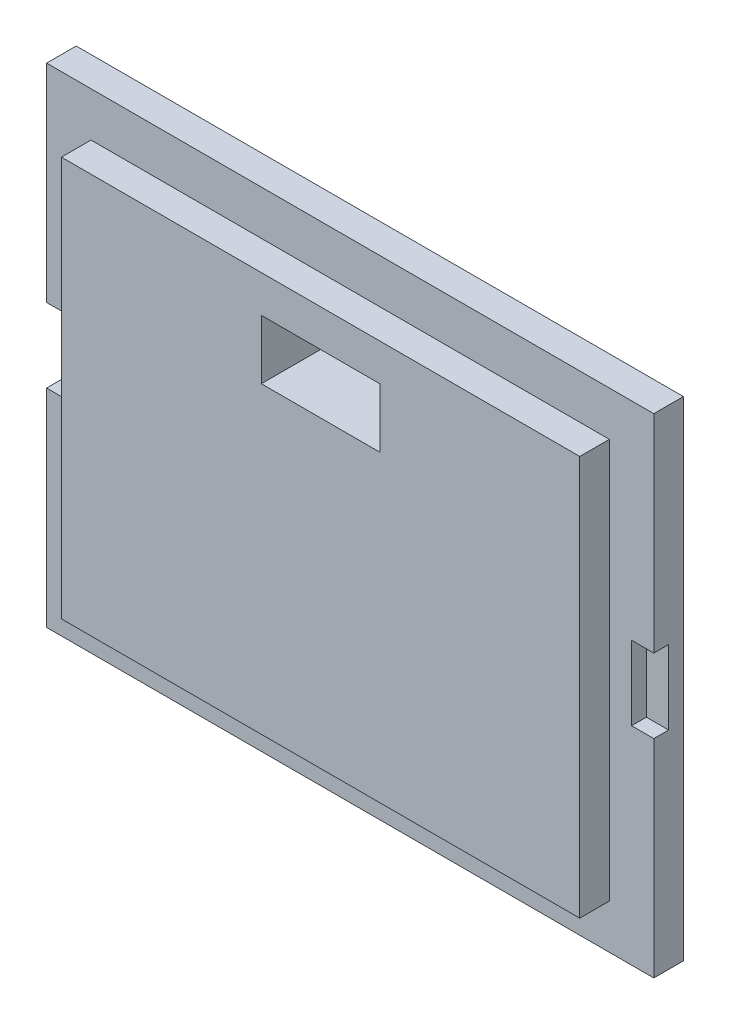
ISO-10303-21;
HEADER;
FILE_DESCRIPTION(('STEP AP214'),'2;1');
FILE_NAME('part.step','',(''),(''),'','','');
FILE_SCHEMA(('AUTOMOTIVE_DESIGN { 1 0 10303 214 1 1 1 1 }'));
ENDSEC;
DATA;
#1=APPLICATION_CONTEXT('core data for automotive mechanical design processes');
#2=APPLICATION_PROTOCOL_DEFINITION('international standard','automotive_design',2000,#1);
#3=PRODUCT_CONTEXT('',#1,'mechanical');
#4=PRODUCT('Part','Part','',(#3));
#5=PRODUCT_RELATED_PRODUCT_CATEGORY('part','',(#4));
#6=PRODUCT_DEFINITION_FORMATION('','',#4);
#7=PRODUCT_DEFINITION_CONTEXT('part definition',#1,'design');
#8=PRODUCT_DEFINITION('design','',#6,#7);
#9=PRODUCT_DEFINITION_SHAPE('','',#8);
#10=(LENGTH_UNIT() NAMED_UNIT(*) SI_UNIT(.MILLI.,.METRE.));
#11=(NAMED_UNIT(*) PLANE_ANGLE_UNIT() SI_UNIT($,.RADIAN.));
#12=(NAMED_UNIT(*) SI_UNIT($,.STERADIAN.) SOLID_ANGLE_UNIT());
#13=UNCERTAINTY_MEASURE_WITH_UNIT(LENGTH_MEASURE(1.E-05),#10,'distance_accuracy_value','');
#14=(GEOMETRIC_REPRESENTATION_CONTEXT(3) GLOBAL_UNCERTAINTY_ASSIGNED_CONTEXT((#13)) GLOBAL_UNIT_ASSIGNED_CONTEXT((#10,
#11,#12)) REPRESENTATION_CONTEXT('',''));
#15=CARTESIAN_POINT('',(0.,0.,0.));
#16=DIRECTION('',(0.,0.,1.));
#17=DIRECTION('',(1.,0.,0.));
#18=AXIS2_PLACEMENT_3D('',#15,#16,#17);
#19=CARTESIAN_POINT('',(0.,0.,2.));
#20=DIRECTION('',(0.,0.,1.));
#21=DIRECTION('',(1.,0.,0.));
#22=AXIS2_PLACEMENT_3D('',#19,#20,#21);
#23=PLANE('',#22);
#24=DIRECTION('',(1.,0.,0.));
#25=VECTOR('',#24,1.);
#26=CARTESIAN_POINT('',(20.5,-2.5,2.));
#27=LINE('',#26,#25);
#28=CARTESIAN_POINT('',(19.,-2.5,2.));
#29=VERTEX_POINT('',#28);
#30=CARTESIAN_POINT('',(20.5,-2.5,2.));
#31=VERTEX_POINT('',#30);
#32=EDGE_CURVE('E190',#29,#31,#27,.T.);
#33=ORIENTED_EDGE('',*,*,#32,.F.);
#34=DIRECTION('',(0.,-1.,0.));
#35=VECTOR('',#34,1.);
#36=CARTESIAN_POINT('',(19.,2.5,2.));
#37=LINE('',#36,#35);
#38=CARTESIAN_POINT('',(19.,2.5,2.));
#39=VERTEX_POINT('',#38);
#40=EDGE_CURVE('E340',#39,#29,#37,.T.);
#41=ORIENTED_EDGE('',*,*,#40,.F.);
#42=DIRECTION('',(-1.,0.,0.));
#43=VECTOR('',#42,1.);
#44=CARTESIAN_POINT('',(20.5,2.5,2.));
#45=LINE('',#44,#43);
#46=CARTESIAN_POINT('',(20.5,2.5,2.));
#47=VERTEX_POINT('',#46);
#48=EDGE_CURVE('E338',#47,#39,#45,.T.);
#49=ORIENTED_EDGE('',*,*,#48,.F.);
#50=DIRECTION('',(0.,1.,0.));
#51=VECTOR('',#50,1.);
#52=CARTESIAN_POINT('',(20.5,16.5,2.));
#53=LINE('',#52,#51);
#54=CARTESIAN_POINT('',(20.5,16.5,2.));
#55=VERTEX_POINT('',#54);
#56=EDGE_CURVE('E195',#47,#55,#53,.T.);
#57=ORIENTED_EDGE('',*,*,#56,.T.);
#58=DIRECTION('',(-1.,0.,0.));
#59=VECTOR('',#58,1.);
#60=CARTESIAN_POINT('',(-20.5,16.5,2.));
#61=LINE('',#60,#59);
#62=CARTESIAN_POINT('',(-20.5,16.5,2.));
#63=VERTEX_POINT('',#62);
#64=EDGE_CURVE('E299',#55,#63,#61,.T.);
#65=ORIENTED_EDGE('',*,*,#64,.T.);
#66=DIRECTION('',(0.,-1.,0.));
#67=VECTOR('',#66,1.);
#68=CARTESIAN_POINT('',(-20.5,16.5,2.));
#69=LINE('',#68,#67);
#70=CARTESIAN_POINT('',(-20.5,2.5,2.));
#71=VERTEX_POINT('',#70);
#72=EDGE_CURVE('E290',#63,#71,#69,.T.);
#73=ORIENTED_EDGE('',*,*,#72,.T.);
#74=DIRECTION('',(-1.,0.,0.));
#75=VECTOR('',#74,1.);
#76=CARTESIAN_POINT('',(-20.5,2.5,2.));
#77=LINE('',#76,#75);
#78=CARTESIAN_POINT('',(-19.,2.5,2.));
#79=VERTEX_POINT('',#78);
#80=EDGE_CURVE('E205',#79,#71,#77,.T.);
#81=ORIENTED_EDGE('',*,*,#80,.F.);
#82=DIRECTION('',(0.,1.,0.));
#83=VECTOR('',#82,1.);
#84=CARTESIAN_POINT('',(-19.,2.5,2.));
#85=LINE('',#84,#83);
#86=CARTESIAN_POINT('',(-19.,-2.5,2.));
#87=VERTEX_POINT('',#86);
#88=EDGE_CURVE('E215',#87,#79,#85,.T.);
#89=ORIENTED_EDGE('',*,*,#88,.F.);
#90=DIRECTION('',(1.,0.,0.));
#91=VECTOR('',#90,1.);
#92=CARTESIAN_POINT('',(-20.5,-2.5,2.));
#93=LINE('',#92,#91);
#94=CARTESIAN_POINT('',(-20.5,-2.5,2.));
#95=VERTEX_POINT('',#94);
#96=EDGE_CURVE('E212',#95,#87,#93,.T.);
#97=ORIENTED_EDGE('',*,*,#96,.F.);
#98=CARTESIAN_POINT('',(-20.5,-16.5,2.));
#99=VERTEX_POINT('',#98);
#100=EDGE_CURVE('E294',#95,#99,#69,.T.);
#101=ORIENTED_EDGE('',*,*,#100,.T.);
#102=DIRECTION('',(1.,0.,0.));
#103=VECTOR('',#102,1.);
#104=CARTESIAN_POINT('',(-20.5,-16.5,2.));
#105=LINE('',#104,#103);
#106=CARTESIAN_POINT('',(20.5,-16.5,2.));
#107=VERTEX_POINT('',#106);
#108=EDGE_CURVE('E293',#99,#107,#105,.T.);
#109=ORIENTED_EDGE('',*,*,#108,.T.);
#110=EDGE_CURVE('E296',#107,#31,#53,.T.);
#111=ORIENTED_EDGE('',*,*,#110,.T.);
#112=EDGE_LOOP('',(#33,#41,#49,#57,#65,#73,#81,#89,#97,#101,#109,#111));
#113=FACE_BOUND('',#112,.T.);
#114=DIRECTION('',(1.,0.,0.));
#115=VECTOR('',#114,1.);
#116=CARTESIAN_POINT('',(-17.5,-13.5,2.));
#117=LINE('',#116,#115);
#118=CARTESIAN_POINT('',(-17.5,-13.5,2.));
#119=VERTEX_POINT('',#118);
#120=CARTESIAN_POINT('',(17.5,-13.5,2.));
#121=VERTEX_POINT('',#120);
#122=EDGE_CURVE('E274',#119,#121,#117,.T.);
#123=ORIENTED_EDGE('',*,*,#122,.F.);
#124=DIRECTION('',(0.,-1.,0.));
#125=VECTOR('',#124,1.);
#126=CARTESIAN_POINT('',(-17.5,13.5,2.));
#127=LINE('',#126,#125);
#128=CARTESIAN_POINT('',(-17.5,13.5,2.));
#129=VERTEX_POINT('',#128);
#130=EDGE_CURVE('E260',#129,#119,#127,.T.);
#131=ORIENTED_EDGE('',*,*,#130,.F.);
#132=DIRECTION('',(-1.,0.,0.));
#133=VECTOR('',#132,1.);
#134=CARTESIAN_POINT('',(-17.5,13.5,2.));
#135=LINE('',#134,#133);
#136=CARTESIAN_POINT('',(17.5,13.5,2.));
#137=VERTEX_POINT('',#136);
#138=EDGE_CURVE('E265',#137,#129,#135,.T.);
#139=ORIENTED_EDGE('',*,*,#138,.F.);
#140=DIRECTION('',(0.,1.,0.));
#141=VECTOR('',#140,1.);
#142=CARTESIAN_POINT('',(17.5,13.5,2.));
#143=LINE('',#142,#141);
#144=EDGE_CURVE('E276',#121,#137,#143,.T.);
#145=ORIENTED_EDGE('',*,*,#144,.F.);
#146=EDGE_LOOP('',(#123,#131,#139,#145));
#147=FACE_BOUND('',#146,.T.);
#148=ADVANCED_FACE('F35',(#113,#147),#23,.T.);
#149=CARTESIAN_POINT('',(-20.5,16.5,2.));
#150=DIRECTION('',(1.,0.,0.));
#151=DIRECTION('',(0.,0.,-1.));
#152=AXIS2_PLACEMENT_3D('',#149,#150,#151);
#153=PLANE('',#152);
#154=DIRECTION('',(0.,-1.,0.));
#155=VECTOR('',#154,1.);
#156=CARTESIAN_POINT('',(-20.5,2.5,1.));
#157=LINE('',#156,#155);
#158=CARTESIAN_POINT('',(-20.5,2.5,1.));
#159=VERTEX_POINT('',#158);
#160=CARTESIAN_POINT('',(-20.5,-2.5,1.));
#161=VERTEX_POINT('',#160);
#162=EDGE_CURVE('E202',#159,#161,#157,.T.);
#163=ORIENTED_EDGE('',*,*,#162,.F.);
#164=DIRECTION('',(0.,0.,1.));
#165=VECTOR('',#164,1.);
#166=CARTESIAN_POINT('',(-20.5,2.5,1.));
#167=LINE('',#166,#165);
#168=EDGE_CURVE('E220',#159,#71,#167,.T.);
#169=ORIENTED_EDGE('',*,*,#168,.T.);
#170=ORIENTED_EDGE('',*,*,#72,.F.);
#171=DIRECTION('',(0.,0.,-1.));
#172=VECTOR('',#171,1.);
#173=CARTESIAN_POINT('',(-20.5,16.5,2.));
#174=LINE('',#173,#172);
#175=CARTESIAN_POINT('',(-20.5,16.5,0.));
#176=VERTEX_POINT('',#175);
#177=EDGE_CURVE('E301',#63,#176,#174,.T.);
#178=ORIENTED_EDGE('',*,*,#177,.T.);
#179=DIRECTION('',(0.,-1.,0.));
#180=VECTOR('',#179,1.);
#181=CARTESIAN_POINT('',(-20.5,16.5,0.));
#182=LINE('',#181,#180);
#183=CARTESIAN_POINT('',(-20.5,-16.5,0.));
#184=VERTEX_POINT('',#183);
#185=EDGE_CURVE('E289',#176,#184,#182,.T.);
#186=ORIENTED_EDGE('',*,*,#185,.T.);
#187=DIRECTION('',(0.,0.,-1.));
#188=VECTOR('',#187,1.);
#189=CARTESIAN_POINT('',(-20.5,-16.5,2.));
#190=LINE('',#189,#188);
#191=EDGE_CURVE('E11',#99,#184,#190,.T.);
#192=ORIENTED_EDGE('',*,*,#191,.F.);
#193=ORIENTED_EDGE('',*,*,#100,.F.);
#194=DIRECTION('',(0.,0.,1.));
#195=VECTOR('',#194,1.);
#196=CARTESIAN_POINT('',(-20.5,-2.5,1.));
#197=LINE('',#196,#195);
#198=EDGE_CURVE('E211',#161,#95,#197,.T.);
#199=ORIENTED_EDGE('',*,*,#198,.F.);
#200=EDGE_LOOP('',(#163,#169,#170,#178,#186,#192,#193,#199));
#201=FACE_BOUND('',#200,.T.);
#202=ADVANCED_FACE('F37',(#201),#153,.F.);
#203=CARTESIAN_POINT('',(-20.5,-16.5,2.));
#204=DIRECTION('',(0.,1.,0.));
#205=DIRECTION('',(0.,0.,1.));
#206=AXIS2_PLACEMENT_3D('',#203,#204,#205);
#207=PLANE('',#206);
#208=DIRECTION('',(1.,0.,0.));
#209=VECTOR('',#208,1.);
#210=CARTESIAN_POINT('',(-20.5,-16.5,0.));
#211=LINE('',#210,#209);
#212=CARTESIAN_POINT('',(20.5,-16.5,0.));
#213=VERTEX_POINT('',#212);
#214=EDGE_CURVE('E304',#184,#213,#211,.T.);
#215=ORIENTED_EDGE('',*,*,#214,.T.);
#216=DIRECTION('',(0.,0.,-1.));
#217=VECTOR('',#216,1.);
#218=CARTESIAN_POINT('',(20.5,-16.5,2.));
#219=LINE('',#218,#217);
#220=EDGE_CURVE('E43',#107,#213,#219,.T.);
#221=ORIENTED_EDGE('',*,*,#220,.F.);
#222=ORIENTED_EDGE('',*,*,#108,.F.);
#223=ORIENTED_EDGE('',*,*,#191,.T.);
#224=EDGE_LOOP('',(#215,#221,#222,#223));
#225=FACE_BOUND('',#224,.T.);
#226=ADVANCED_FACE('F352',(#225),#207,.F.);
#227=CARTESIAN_POINT('',(20.5,16.5,2.));
#228=DIRECTION('',(-1.,0.,0.));
#229=DIRECTION('',(0.,0.,1.));
#230=AXIS2_PLACEMENT_3D('',#227,#228,#229);
#231=PLANE('',#230);
#232=DIRECTION('',(0.,1.,0.));
#233=VECTOR('',#232,1.);
#234=CARTESIAN_POINT('',(20.5,2.5,1.));
#235=LINE('',#234,#233);
#236=CARTESIAN_POINT('',(20.5,-2.5,1.));
#237=VERTEX_POINT('',#236);
#238=CARTESIAN_POINT('',(20.5,2.5,1.));
#239=VERTEX_POINT('',#238);
#240=EDGE_CURVE('E184',#237,#239,#235,.T.);
#241=ORIENTED_EDGE('',*,*,#240,.F.);
#242=DIRECTION('',(0.,0.,1.));
#243=VECTOR('',#242,1.);
#244=CARTESIAN_POINT('',(20.5,-2.5,1.));
#245=LINE('',#244,#243);
#246=EDGE_CURVE('E216',#237,#31,#245,.T.);
#247=ORIENTED_EDGE('',*,*,#246,.T.);
#248=ORIENTED_EDGE('',*,*,#110,.F.);
#249=ORIENTED_EDGE('',*,*,#220,.T.);
#250=DIRECTION('',(0.,1.,0.));
#251=VECTOR('',#250,1.);
#252=CARTESIAN_POINT('',(20.5,16.5,0.));
#253=LINE('',#252,#251);
#254=CARTESIAN_POINT('',(20.5,16.5,0.));
#255=VERTEX_POINT('',#254);
#256=EDGE_CURVE('E306',#213,#255,#253,.T.);
#257=ORIENTED_EDGE('',*,*,#256,.T.);
#258=DIRECTION('',(0.,0.,-1.));
#259=VECTOR('',#258,1.);
#260=CARTESIAN_POINT('',(20.5,16.5,2.));
#261=LINE('',#260,#259);
#262=EDGE_CURVE('E312',#55,#255,#261,.T.);
#263=ORIENTED_EDGE('',*,*,#262,.F.);
#264=ORIENTED_EDGE('',*,*,#56,.F.);
#265=DIRECTION('',(0.,0.,1.));
#266=VECTOR('',#265,1.);
#267=CARTESIAN_POINT('',(20.5,2.5,1.));
#268=LINE('',#267,#266);
#269=EDGE_CURVE('E179',#239,#47,#268,.T.);
#270=ORIENTED_EDGE('',*,*,#269,.F.);
#271=EDGE_LOOP('',(#241,#247,#248,#249,#257,#263,#264,#270));
#272=FACE_BOUND('',#271,.T.);
#273=ADVANCED_FACE('F193',(#272),#231,.F.);
#274=CARTESIAN_POINT('',(-20.5,16.5,2.));
#275=DIRECTION('',(0.,-1.,0.));
#276=DIRECTION('',(0.,0.,-1.));
#277=AXIS2_PLACEMENT_3D('',#274,#275,#276);
#278=PLANE('',#277);
#279=DIRECTION('',(-1.,0.,0.));
#280=VECTOR('',#279,1.);
#281=CARTESIAN_POINT('',(-20.5,16.5,0.));
#282=LINE('',#281,#280);
#283=EDGE_CURVE('E308',#255,#176,#282,.T.);
#284=ORIENTED_EDGE('',*,*,#283,.T.);
#285=ORIENTED_EDGE('',*,*,#177,.F.);
#286=ORIENTED_EDGE('',*,*,#64,.F.);
#287=ORIENTED_EDGE('',*,*,#262,.T.);
#288=EDGE_LOOP('',(#284,#285,#286,#287));
#289=FACE_BOUND('',#288,.T.);
#290=ADVANCED_FACE('F326',(#289),#278,.F.);
#291=CARTESIAN_POINT('',(0.,0.,0.));
#292=DIRECTION('',(0.,0.,1.));
#293=DIRECTION('',(1.,0.,0.));
#294=AXIS2_PLACEMENT_3D('',#291,#292,#293);
#295=PLANE('',#294);
#296=DIRECTION('',(1.,0.,0.));
#297=VECTOR('',#296,1.);
#298=CARTESIAN_POINT('',(0.,7.,0.));
#299=LINE('',#298,#297);
#300=CARTESIAN_POINT('',(-4.00000000000001,7.,0.));
#301=VERTEX_POINT('',#300);
#302=CARTESIAN_POINT('',(3.99999999999999,7.,0.));
#303=VERTEX_POINT('',#302);
#304=EDGE_CURVE('E254',#301,#303,#299,.T.);
#305=ORIENTED_EDGE('',*,*,#304,.T.);
#306=DIRECTION('',(0.,1.,0.));
#307=VECTOR('',#306,1.);
#308=CARTESIAN_POINT('',(3.99999999999999,0.,0.));
#309=LINE('',#308,#307);
#310=CARTESIAN_POINT('',(3.99999999999999,11.,0.));
#311=VERTEX_POINT('',#310);
#312=EDGE_CURVE('E257',#303,#311,#309,.T.);
#313=ORIENTED_EDGE('',*,*,#312,.T.);
#314=DIRECTION('',(-1.,0.,0.));
#315=VECTOR('',#314,1.);
#316=CARTESIAN_POINT('',(0.,11.,0.));
#317=LINE('',#316,#315);
#318=CARTESIAN_POINT('',(-4.00000000000001,11.,0.));
#319=VERTEX_POINT('',#318);
#320=EDGE_CURVE('E242',#311,#319,#317,.T.);
#321=ORIENTED_EDGE('',*,*,#320,.T.);
#322=DIRECTION('',(0.,-1.,0.));
#323=VECTOR('',#322,1.);
#324=CARTESIAN_POINT('',(-4.00000000000001,0.,0.));
#325=LINE('',#324,#323);
#326=EDGE_CURVE('E251',#319,#301,#325,.T.);
#327=ORIENTED_EDGE('',*,*,#326,.T.);
#328=EDGE_LOOP('',(#305,#313,#321,#327));
#329=FACE_BOUND('',#328,.T.);
#330=ORIENTED_EDGE('',*,*,#185,.F.);
#331=ORIENTED_EDGE('',*,*,#283,.F.);
#332=ORIENTED_EDGE('',*,*,#256,.F.);
#333=ORIENTED_EDGE('',*,*,#214,.F.);
#334=EDGE_LOOP('',(#330,#331,#332,#333));
#335=FACE_BOUND('',#334,.T.);
#336=ADVANCED_FACE('F323',(#329,#335),#295,.F.);
#337=CARTESIAN_POINT('',(-17.5,13.5,4.));
#338=DIRECTION('',(1.,0.,0.));
#339=DIRECTION('',(0.,0.,-1.));
#340=AXIS2_PLACEMENT_3D('',#337,#338,#339);
#341=PLANE('',#340);
#342=ORIENTED_EDGE('',*,*,#130,.T.);
#343=DIRECTION('',(0.,0.,-1.));
#344=VECTOR('',#343,1.);
#345=CARTESIAN_POINT('',(-17.5,-13.5,4.));
#346=LINE('',#345,#344);
#347=CARTESIAN_POINT('',(-17.5,-13.5,4.));
#348=VERTEX_POINT('',#347);
#349=EDGE_CURVE('E287',#348,#119,#346,.T.);
#350=ORIENTED_EDGE('',*,*,#349,.F.);
#351=DIRECTION('',(0.,-1.,0.));
#352=VECTOR('',#351,1.);
#353=CARTESIAN_POINT('',(-17.5,13.5,4.));
#354=LINE('',#353,#352);
#355=CARTESIAN_POINT('',(-17.5,13.5,4.));
#356=VERTEX_POINT('',#355);
#357=EDGE_CURVE('E261',#356,#348,#354,.T.);
#358=ORIENTED_EDGE('',*,*,#357,.F.);
#359=DIRECTION('',(0.,0.,-1.));
#360=VECTOR('',#359,1.);
#361=CARTESIAN_POINT('',(-17.5,13.5,4.));
#362=LINE('',#361,#360);
#363=EDGE_CURVE('E271',#356,#129,#362,.T.);
#364=ORIENTED_EDGE('',*,*,#363,.T.);
#365=EDGE_LOOP('',(#342,#350,#358,#364));
#366=FACE_BOUND('',#365,.T.);
#367=ADVANCED_FACE('F377',(#366),#341,.F.);
#368=CARTESIAN_POINT('',(-17.5,-13.5,4.));
#369=DIRECTION('',(0.,1.,0.));
#370=DIRECTION('',(-1.,0.,0.));
#371=AXIS2_PLACEMENT_3D('',#368,#369,#370);
#372=PLANE('',#371);
#373=ORIENTED_EDGE('',*,*,#122,.T.);
#374=DIRECTION('',(0.,0.,-1.));
#375=VECTOR('',#374,1.);
#376=CARTESIAN_POINT('',(17.5,-13.5,4.));
#377=LINE('',#376,#375);
#378=CARTESIAN_POINT('',(17.5,-13.5,4.));
#379=VERTEX_POINT('',#378);
#380=EDGE_CURVE('E284',#379,#121,#377,.T.);
#381=ORIENTED_EDGE('',*,*,#380,.F.);
#382=DIRECTION('',(1.,0.,0.));
#383=VECTOR('',#382,1.);
#384=CARTESIAN_POINT('',(-17.5,-13.5,4.));
#385=LINE('',#384,#383);
#386=EDGE_CURVE('E264',#348,#379,#385,.T.);
#387=ORIENTED_EDGE('',*,*,#386,.F.);
#388=ORIENTED_EDGE('',*,*,#349,.T.);
#389=EDGE_LOOP('',(#373,#381,#387,#388));
#390=FACE_BOUND('',#389,.T.);
#391=ADVANCED_FACE('F411',(#390),#372,.F.);
#392=CARTESIAN_POINT('',(17.5,13.5,4.));
#393=DIRECTION('',(-1.,0.,0.));
#394=DIRECTION('',(0.,0.,1.));
#395=AXIS2_PLACEMENT_3D('',#392,#393,#394);
#396=PLANE('',#395);
#397=ORIENTED_EDGE('',*,*,#144,.T.);
#398=DIRECTION('',(0.,0.,-1.));
#399=VECTOR('',#398,1.);
#400=CARTESIAN_POINT('',(17.5,13.5,4.));
#401=LINE('',#400,#399);
#402=CARTESIAN_POINT('',(17.5,13.5,4.));
#403=VERTEX_POINT('',#402);
#404=EDGE_CURVE('E282',#403,#137,#401,.T.);
#405=ORIENTED_EDGE('',*,*,#404,.F.);
#406=DIRECTION('',(0.,1.,0.));
#407=VECTOR('',#406,1.);
#408=CARTESIAN_POINT('',(17.5,13.5,4.));
#409=LINE('',#408,#407);
#410=EDGE_CURVE('E267',#379,#403,#409,.T.);
#411=ORIENTED_EDGE('',*,*,#410,.F.);
#412=ORIENTED_EDGE('',*,*,#380,.T.);
#413=EDGE_LOOP('',(#397,#405,#411,#412));
#414=FACE_BOUND('',#413,.T.);
#415=ADVANCED_FACE('F418',(#414),#396,.F.);
#416=CARTESIAN_POINT('',(-17.5,13.5,4.));
#417=DIRECTION('',(0.,-1.,0.));
#418=DIRECTION('',(1.,0.,0.));
#419=AXIS2_PLACEMENT_3D('',#416,#417,#418);
#420=PLANE('',#419);
#421=ORIENTED_EDGE('',*,*,#138,.T.);
#422=ORIENTED_EDGE('',*,*,#363,.F.);
#423=DIRECTION('',(-1.,0.,0.));
#424=VECTOR('',#423,1.);
#425=CARTESIAN_POINT('',(-17.5,13.5,4.));
#426=LINE('',#425,#424);
#427=EDGE_CURVE('E269',#403,#356,#426,.T.);
#428=ORIENTED_EDGE('',*,*,#427,.F.);
#429=ORIENTED_EDGE('',*,*,#404,.T.);
#430=EDGE_LOOP('',(#421,#422,#428,#429));
#431=FACE_BOUND('',#430,.T.);
#432=ADVANCED_FACE('F425',(#431),#420,.F.);
#433=CARTESIAN_POINT('',(0.,0.,4.));
#434=DIRECTION('',(0.,0.,1.));
#435=DIRECTION('',(1.,0.,0.));
#436=AXIS2_PLACEMENT_3D('',#433,#434,#435);
#437=PLANE('',#436);
#438=DIRECTION('',(0.,1.,0.));
#439=VECTOR('',#438,1.);
#440=CARTESIAN_POINT('',(3.99999999999999,7.,4.));
#441=LINE('',#440,#439);
#442=CARTESIAN_POINT('',(3.99999999999999,7.,4.));
#443=VERTEX_POINT('',#442);
#444=CARTESIAN_POINT('',(3.99999999999999,11.,4.));
#445=VERTEX_POINT('',#444);
#446=EDGE_CURVE('E223',#443,#445,#441,.T.);
#447=ORIENTED_EDGE('',*,*,#446,.F.);
#448=DIRECTION('',(1.,0.,0.));
#449=VECTOR('',#448,1.);
#450=CARTESIAN_POINT('',(-4.00000000000001,7.,4.));
#451=LINE('',#450,#449);
#452=CARTESIAN_POINT('',(-4.00000000000001,7.,4.));
#453=VERTEX_POINT('',#452);
#454=EDGE_CURVE('E236',#453,#443,#451,.T.);
#455=ORIENTED_EDGE('',*,*,#454,.F.);
#456=DIRECTION('',(0.,-1.,0.));
#457=VECTOR('',#456,1.);
#458=CARTESIAN_POINT('',(-4.00000000000001,7.,4.));
#459=LINE('',#458,#457);
#460=CARTESIAN_POINT('',(-4.00000000000001,11.,4.));
#461=VERTEX_POINT('',#460);
#462=EDGE_CURVE('E233',#461,#453,#459,.T.);
#463=ORIENTED_EDGE('',*,*,#462,.F.);
#464=DIRECTION('',(-1.,0.,0.));
#465=VECTOR('',#464,1.);
#466=CARTESIAN_POINT('',(-4.00000000000001,11.,4.));
#467=LINE('',#466,#465);
#468=EDGE_CURVE('E230',#445,#461,#467,.T.);
#469=ORIENTED_EDGE('',*,*,#468,.F.);
#470=EDGE_LOOP('',(#447,#455,#463,#469));
#471=FACE_BOUND('',#470,.T.);
#472=ORIENTED_EDGE('',*,*,#357,.T.);
#473=ORIENTED_EDGE('',*,*,#386,.T.);
#474=ORIENTED_EDGE('',*,*,#410,.T.);
#475=ORIENTED_EDGE('',*,*,#427,.T.);
#476=EDGE_LOOP('',(#472,#473,#474,#475));
#477=FACE_BOUND('',#476,.T.);
#478=ADVANCED_FACE('F432',(#471,#477),#437,.T.);
#479=CARTESIAN_POINT('',(3.99999999999999,7.,-1.));
#480=DIRECTION('',(1.,0.,0.));
#481=DIRECTION('',(0.,0.,-1.));
#482=AXIS2_PLACEMENT_3D('',#479,#480,#481);
#483=PLANE('',#482);
#484=DIRECTION('',(0.,0.,1.));
#485=VECTOR('',#484,1.);
#486=CARTESIAN_POINT('',(3.99999999999999,7.,-1.));
#487=LINE('',#486,#485);
#488=EDGE_CURVE('E240',#303,#443,#487,.T.);
#489=ORIENTED_EDGE('',*,*,#488,.T.);
#490=ORIENTED_EDGE('',*,*,#446,.T.);
#491=DIRECTION('',(0.,0.,1.));
#492=VECTOR('',#491,1.);
#493=CARTESIAN_POINT('',(3.99999999999999,11.,-1.));
#494=LINE('',#493,#492);
#495=EDGE_CURVE('E239',#311,#445,#494,.T.);
#496=ORIENTED_EDGE('',*,*,#495,.F.);
#497=ORIENTED_EDGE('',*,*,#312,.F.);
#498=EDGE_LOOP('',(#489,#490,#496,#497));
#499=FACE_BOUND('',#498,.T.);
#500=ADVANCED_FACE('F439',(#499),#483,.F.);
#501=CARTESIAN_POINT('',(-4.00000000000001,7.,-1.));
#502=DIRECTION('',(0.,-1.,0.));
#503=DIRECTION('',(0.,0.,-1.));
#504=AXIS2_PLACEMENT_3D('',#501,#502,#503);
#505=PLANE('',#504);
#506=DIRECTION('',(0.,0.,1.));
#507=VECTOR('',#506,1.);
#508=CARTESIAN_POINT('',(-4.00000000000001,7.,-1.));
#509=LINE('',#508,#507);
#510=EDGE_CURVE('E243',#301,#453,#509,.T.);
#511=ORIENTED_EDGE('',*,*,#510,.T.);
#512=ORIENTED_EDGE('',*,*,#454,.T.);
#513=ORIENTED_EDGE('',*,*,#488,.F.);
#514=ORIENTED_EDGE('',*,*,#304,.F.);
#515=EDGE_LOOP('',(#511,#512,#513,#514));
#516=FACE_BOUND('',#515,.T.);
#517=ADVANCED_FACE('F447',(#516),#505,.F.);
#518=CARTESIAN_POINT('',(-4.00000000000001,7.,-1.));
#519=DIRECTION('',(-1.,0.,0.));
#520=DIRECTION('',(0.,0.,1.));
#521=AXIS2_PLACEMENT_3D('',#518,#519,#520);
#522=PLANE('',#521);
#523=DIRECTION('',(0.,0.,1.));
#524=VECTOR('',#523,1.);
#525=CARTESIAN_POINT('',(-4.00000000000001,11.,-1.));
#526=LINE('',#525,#524);
#527=EDGE_CURVE('E245',#319,#461,#526,.T.);
#528=ORIENTED_EDGE('',*,*,#527,.T.);
#529=ORIENTED_EDGE('',*,*,#462,.T.);
#530=ORIENTED_EDGE('',*,*,#510,.F.);
#531=ORIENTED_EDGE('',*,*,#326,.F.);
#532=EDGE_LOOP('',(#528,#529,#530,#531));
#533=FACE_BOUND('',#532,.T.);
#534=ADVANCED_FACE('F455',(#533),#522,.F.);
#535=CARTESIAN_POINT('',(-4.00000000000001,11.,-1.));
#536=DIRECTION('',(0.,1.,0.));
#537=DIRECTION('',(0.,0.,1.));
#538=AXIS2_PLACEMENT_3D('',#535,#536,#537);
#539=PLANE('',#538);
#540=ORIENTED_EDGE('',*,*,#495,.T.);
#541=ORIENTED_EDGE('',*,*,#468,.T.);
#542=ORIENTED_EDGE('',*,*,#527,.F.);
#543=ORIENTED_EDGE('',*,*,#320,.F.);
#544=EDGE_LOOP('',(#540,#541,#542,#543));
#545=FACE_BOUND('',#544,.T.);
#546=ADVANCED_FACE('F463',(#545),#539,.F.);
#547=CARTESIAN_POINT('',(-20.5,2.5,1.));
#548=DIRECTION('',(0.,1.,0.));
#549=DIRECTION('',(0.,0.,1.));
#550=AXIS2_PLACEMENT_3D('',#547,#548,#549);
#551=PLANE('',#550);
#552=ORIENTED_EDGE('',*,*,#80,.T.);
#553=ORIENTED_EDGE('',*,*,#168,.F.);
#554=DIRECTION('',(-1.,0.,0.));
#555=VECTOR('',#554,1.);
#556=CARTESIAN_POINT('',(-20.5,2.5,1.));
#557=LINE('',#556,#555);
#558=CARTESIAN_POINT('',(-19.,2.5,1.));
#559=VERTEX_POINT('',#558);
#560=EDGE_CURVE('E58',#559,#159,#557,.T.);
#561=ORIENTED_EDGE('',*,*,#560,.F.);
#562=DIRECTION('',(0.,0.,1.));
#563=VECTOR('',#562,1.);
#564=CARTESIAN_POINT('',(-19.,2.5,1.));
#565=LINE('',#564,#563);
#566=EDGE_CURVE('E224',#559,#79,#565,.T.);
#567=ORIENTED_EDGE('',*,*,#566,.T.);
#568=EDGE_LOOP('',(#552,#553,#561,#567));
#569=FACE_BOUND('',#568,.T.);
#570=ADVANCED_FACE('F471',(#569),#551,.F.);
#571=CARTESIAN_POINT('',(-19.,2.5,1.));
#572=DIRECTION('',(1.,0.,0.));
#573=DIRECTION('',(0.,0.,-1.));
#574=AXIS2_PLACEMENT_3D('',#571,#572,#573);
#575=PLANE('',#574);
#576=ORIENTED_EDGE('',*,*,#88,.T.);
#577=ORIENTED_EDGE('',*,*,#566,.F.);
#578=DIRECTION('',(0.,1.,0.));
#579=VECTOR('',#578,1.);
#580=CARTESIAN_POINT('',(-19.,2.5,1.));
#581=LINE('',#580,#579);
#582=CARTESIAN_POINT('',(-19.,-2.5,1.));
#583=VERTEX_POINT('',#582);
#584=EDGE_CURVE('E208',#583,#559,#581,.T.);
#585=ORIENTED_EDGE('',*,*,#584,.F.);
#586=DIRECTION('',(0.,0.,1.));
#587=VECTOR('',#586,1.);
#588=CARTESIAN_POINT('',(-19.,-2.5,1.));
#589=LINE('',#588,#587);
#590=EDGE_CURVE('E226',#583,#87,#589,.T.);
#591=ORIENTED_EDGE('',*,*,#590,.T.);
#592=EDGE_LOOP('',(#576,#577,#585,#591));
#593=FACE_BOUND('',#592,.T.);
#594=ADVANCED_FACE('F357',(#593),#575,.F.);
#595=CARTESIAN_POINT('',(-20.5,-2.5,1.));
#596=DIRECTION('',(0.,-1.,0.));
#597=DIRECTION('',(0.,0.,-1.));
#598=AXIS2_PLACEMENT_3D('',#595,#596,#597);
#599=PLANE('',#598);
#600=ORIENTED_EDGE('',*,*,#96,.T.);
#601=ORIENTED_EDGE('',*,*,#590,.F.);
#602=DIRECTION('',(1.,0.,0.));
#603=VECTOR('',#602,1.);
#604=CARTESIAN_POINT('',(-20.5,-2.5,1.));
#605=LINE('',#604,#603);
#606=EDGE_CURVE('E204',#161,#583,#605,.T.);
#607=ORIENTED_EDGE('',*,*,#606,.F.);
#608=ORIENTED_EDGE('',*,*,#198,.T.);
#609=EDGE_LOOP('',(#600,#601,#607,#608));
#610=FACE_BOUND('',#609,.T.);
#611=ADVANCED_FACE('F355',(#610),#599,.F.);
#612=CARTESIAN_POINT('',(0.,0.,1.));
#613=DIRECTION('',(0.,0.,1.));
#614=DIRECTION('',(1.,0.,0.));
#615=AXIS2_PLACEMENT_3D('',#612,#613,#614);
#616=PLANE('',#615);
#617=ORIENTED_EDGE('',*,*,#162,.T.);
#618=ORIENTED_EDGE('',*,*,#606,.T.);
#619=ORIENTED_EDGE('',*,*,#584,.T.);
#620=ORIENTED_EDGE('',*,*,#560,.T.);
#621=EDGE_LOOP('',(#617,#618,#619,#620));
#622=FACE_BOUND('',#621,.T.);
#623=ADVANCED_FACE('F359',(#622),#616,.T.);
#624=CARTESIAN_POINT('',(20.5,-2.5,1.));
#625=DIRECTION('',(0.,-1.,0.));
#626=DIRECTION('',(0.,0.,-1.));
#627=AXIS2_PLACEMENT_3D('',#624,#625,#626);
#628=PLANE('',#627);
#629=ORIENTED_EDGE('',*,*,#32,.T.);
#630=ORIENTED_EDGE('',*,*,#246,.F.);
#631=DIRECTION('',(1.,0.,0.));
#632=VECTOR('',#631,1.);
#633=CARTESIAN_POINT('',(20.5,-2.5,1.));
#634=LINE('',#633,#632);
#635=CARTESIAN_POINT('',(19.,-2.5,1.));
#636=VERTEX_POINT('',#635);
#637=EDGE_CURVE('E50',#636,#237,#634,.T.);
#638=ORIENTED_EDGE('',*,*,#637,.F.);
#639=DIRECTION('',(0.,0.,1.));
#640=VECTOR('',#639,1.);
#641=CARTESIAN_POINT('',(19.,-2.5,1.));
#642=LINE('',#641,#640);
#643=EDGE_CURVE('E197',#636,#29,#642,.T.);
#644=ORIENTED_EDGE('',*,*,#643,.T.);
#645=EDGE_LOOP('',(#629,#630,#638,#644));
#646=FACE_BOUND('',#645,.T.);
#647=ADVANCED_FACE('F347',(#646),#628,.F.);
#648=CARTESIAN_POINT('',(19.,2.5,1.));
#649=DIRECTION('',(-1.,0.,0.));
#650=DIRECTION('',(0.,0.,1.));
#651=AXIS2_PLACEMENT_3D('',#648,#649,#650);
#652=PLANE('',#651);
#653=ORIENTED_EDGE('',*,*,#40,.T.);
#654=ORIENTED_EDGE('',*,*,#643,.F.);
#655=DIRECTION('',(0.,-1.,0.));
#656=VECTOR('',#655,1.);
#657=CARTESIAN_POINT('',(19.,2.5,1.));
#658=LINE('',#657,#656);
#659=CARTESIAN_POINT('',(19.,2.5,1.));
#660=VERTEX_POINT('',#659);
#661=EDGE_CURVE('E183',#660,#636,#658,.T.);
#662=ORIENTED_EDGE('',*,*,#661,.F.);
#663=DIRECTION('',(0.,0.,1.));
#664=VECTOR('',#663,1.);
#665=CARTESIAN_POINT('',(19.,2.5,1.));
#666=LINE('',#665,#664);
#667=EDGE_CURVE('E181',#660,#39,#666,.T.);
#668=ORIENTED_EDGE('',*,*,#667,.T.);
#669=EDGE_LOOP('',(#653,#654,#662,#668));
#670=FACE_BOUND('',#669,.T.);
#671=ADVANCED_FACE('F349',(#670),#652,.F.);
#672=CARTESIAN_POINT('',(20.5,2.5,1.));
#673=DIRECTION('',(0.,1.,0.));
#674=DIRECTION('',(0.,0.,1.));
#675=AXIS2_PLACEMENT_3D('',#672,#673,#674);
#676=PLANE('',#675);
#677=ORIENTED_EDGE('',*,*,#48,.T.);
#678=ORIENTED_EDGE('',*,*,#667,.F.);
#679=DIRECTION('',(-1.,0.,0.));
#680=VECTOR('',#679,1.);
#681=CARTESIAN_POINT('',(20.5,2.5,1.));
#682=LINE('',#681,#680);
#683=EDGE_CURVE('E175',#239,#660,#682,.T.);
#684=ORIENTED_EDGE('',*,*,#683,.F.);
#685=ORIENTED_EDGE('',*,*,#269,.T.);
#686=EDGE_LOOP('',(#677,#678,#684,#685));
#687=FACE_BOUND('',#686,.T.);
#688=ADVANCED_FACE('F177',(#687),#676,.F.);
#689=CARTESIAN_POINT('',(0.,0.,1.));
#690=DIRECTION('',(0.,0.,-1.));
#691=DIRECTION('',(-1.,0.,0.));
#692=AXIS2_PLACEMENT_3D('',#689,#690,#691);
#693=PLANE('',#692);
#694=ORIENTED_EDGE('',*,*,#240,.T.);
#695=ORIENTED_EDGE('',*,*,#683,.T.);
#696=ORIENTED_EDGE('',*,*,#661,.T.);
#697=ORIENTED_EDGE('',*,*,#637,.T.);
#698=EDGE_LOOP('',(#694,#695,#696,#697));
#699=FACE_BOUND('',#698,.T.);
#700=ADVANCED_FACE('F187',(#699),#693,.F.);
#701=CLOSED_SHELL('',(#148,#202,#226,#273,#290,#336,#367,#391,#415,#432,#478,#500,#517,#534,
#546,#570,#594,#611,#623,#647,#671,#688,#700));
#702=MANIFOLD_SOLID_BREP('B2',#701);
#703=ADVANCED_BREP_SHAPE_REPRESENTATION('',(#18,#702),#14);
#704=SHAPE_DEFINITION_REPRESENTATION(#9,#703);
ENDSEC;
END-ISO-10303-21;
